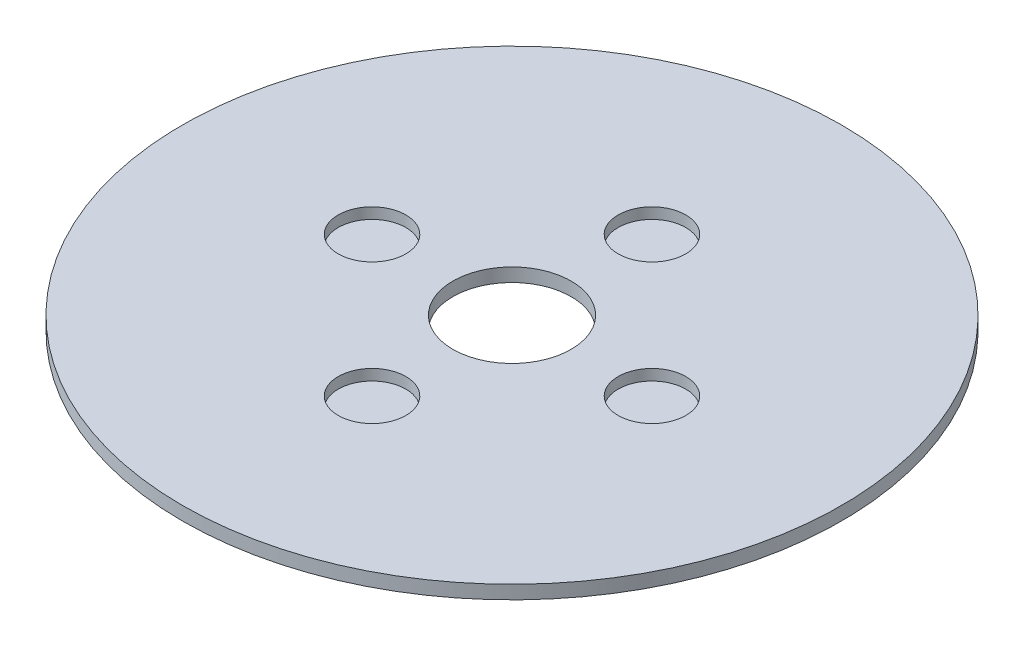
ISO-10303-21;
HEADER;
FILE_DESCRIPTION(('STEP AP214'),'2;1');
FILE_NAME('part.step','',(''),(''),'','','');
FILE_SCHEMA(('AUTOMOTIVE_DESIGN { 1 0 10303 214 1 1 1 1 }'));
ENDSEC;
DATA;
#1=APPLICATION_CONTEXT('core data for automotive mechanical design processes');
#2=APPLICATION_PROTOCOL_DEFINITION('international standard','automotive_design',2000,#1);
#3=PRODUCT_CONTEXT('',#1,'mechanical');
#4=PRODUCT('Part','Part','',(#3));
#5=PRODUCT_RELATED_PRODUCT_CATEGORY('part','',(#4));
#6=PRODUCT_DEFINITION_FORMATION('','',#4);
#7=PRODUCT_DEFINITION_CONTEXT('part definition',#1,'design');
#8=PRODUCT_DEFINITION('design','',#6,#7);
#9=PRODUCT_DEFINITION_SHAPE('','',#8);
#10=(LENGTH_UNIT() NAMED_UNIT(*) SI_UNIT(.MILLI.,.METRE.));
#11=(NAMED_UNIT(*) PLANE_ANGLE_UNIT() SI_UNIT($,.RADIAN.));
#12=(NAMED_UNIT(*) SI_UNIT($,.STERADIAN.) SOLID_ANGLE_UNIT());
#13=UNCERTAINTY_MEASURE_WITH_UNIT(LENGTH_MEASURE(1.E-05),#10,'distance_accuracy_value','');
#14=(GEOMETRIC_REPRESENTATION_CONTEXT(3) GLOBAL_UNCERTAINTY_ASSIGNED_CONTEXT((#13)) GLOBAL_UNIT_ASSIGNED_CONTEXT((#10,
#11,#12)) REPRESENTATION_CONTEXT('',''));
#15=CARTESIAN_POINT('',(0.,0.,0.));
#16=DIRECTION('',(0.,0.,1.));
#17=DIRECTION('',(1.,0.,0.));
#18=AXIS2_PLACEMENT_3D('',#15,#16,#17);
#19=CARTESIAN_POINT('',(0.,4.,0.));
#20=DIRECTION('',(0.,-1.,0.));
#21=DIRECTION('',(0.,0.,-1.));
#22=AXIS2_PLACEMENT_3D('',#19,#20,#21);
#23=CYLINDRICAL_SURFACE('',#22,97.5);
#24=CARTESIAN_POINT('',(0.,4.,0.));
#25=DIRECTION('',(0.,1.,0.));
#26=DIRECTION('',(0.,0.,1.));
#27=AXIS2_PLACEMENT_3D('',#24,#25,#26);
#28=CIRCLE('',#27,97.5);
#29=CARTESIAN_POINT('',(0.,4.,97.5));
#30=VERTEX_POINT('',#29);
#31=EDGE_CURVE('E10',#30,#30,#28,.T.);
#32=ORIENTED_EDGE('',*,*,#31,.F.);
#33=EDGE_LOOP('',(#32));
#34=FACE_BOUND('',#33,.T.);
#35=CARTESIAN_POINT('',(0.,0.,0.));
#36=DIRECTION('',(0.,1.,0.));
#37=DIRECTION('',(0.,0.,1.));
#38=AXIS2_PLACEMENT_3D('',#35,#36,#37);
#39=CIRCLE('',#38,97.5);
#40=CARTESIAN_POINT('',(0.,0.,97.5));
#41=VERTEX_POINT('',#40);
#42=EDGE_CURVE('E37',#41,#41,#39,.T.);
#43=ORIENTED_EDGE('',*,*,#42,.T.);
#44=EDGE_LOOP('',(#43));
#45=FACE_BOUND('',#44,.T.);
#46=ADVANCED_FACE('F40',(#34,#45),#23,.T.);
#47=CARTESIAN_POINT('',(0.,4.,0.));
#48=DIRECTION('',(0.,1.,0.));
#49=DIRECTION('',(0.,0.,1.));
#50=AXIS2_PLACEMENT_3D('',#47,#48,#49);
#51=PLANE('',#50);
#52=CARTESIAN_POINT('',(1.445771799954E-13,4.,41.4085501150937));
#53=DIRECTION('',(0.,1.,0.));
#54=DIRECTION('',(1.,0.,0.));
#55=AXIS2_PLACEMENT_3D('',#52,#53,#54);
#56=CIRCLE('',#55,10.);
#57=CARTESIAN_POINT('',(10.0000000000001,4.,41.4085501150937));
#58=VERTEX_POINT('',#57);
#59=EDGE_CURVE('E71',#58,#58,#56,.T.);
#60=ORIENTED_EDGE('',*,*,#59,.F.);
#61=EDGE_LOOP('',(#60));
#62=FACE_BOUND('',#61,.T.);
#63=CARTESIAN_POINT('',(41.4085501150937,4.,0.));
#64=DIRECTION('',(0.,1.,0.));
#65=DIRECTION('',(0.,0.,-1.));
#66=AXIS2_PLACEMENT_3D('',#63,#64,#65);
#67=CIRCLE('',#66,10.);
#68=CARTESIAN_POINT('',(41.4085501150937,4.,-10.));
#69=VERTEX_POINT('',#68);
#70=EDGE_CURVE('E70',#69,#69,#67,.T.);
#71=ORIENTED_EDGE('',*,*,#70,.F.);
#72=EDGE_LOOP('',(#71));
#73=FACE_BOUND('',#72,.T.);
#74=CARTESIAN_POINT('',(-4.33731539986201E-13,4.,-41.4085501150937));
#75=DIRECTION('',(0.,1.,0.));
#76=DIRECTION('',(-1.,0.,0.));
#77=AXIS2_PLACEMENT_3D('',#74,#75,#76);
#78=CIRCLE('',#77,10.);
#79=CARTESIAN_POINT('',(-10.0000000000004,4.,-41.4085501150936));
#80=VERTEX_POINT('',#79);
#81=EDGE_CURVE('E61',#80,#80,#78,.T.);
#82=ORIENTED_EDGE('',*,*,#81,.F.);
#83=EDGE_LOOP('',(#82));
#84=FACE_BOUND('',#83,.T.);
#85=CARTESIAN_POINT('',(-41.4085501150937,4.,0.));
#86=DIRECTION('',(0.,1.,0.));
#87=DIRECTION('',(0.,0.,1.));
#88=AXIS2_PLACEMENT_3D('',#85,#86,#87);
#89=CIRCLE('',#88,10.);
#90=CARTESIAN_POINT('',(-41.4085501150937,4.,10.));
#91=VERTEX_POINT('',#90);
#92=EDGE_CURVE('E54',#91,#91,#89,.T.);
#93=ORIENTED_EDGE('',*,*,#92,.F.);
#94=EDGE_LOOP('',(#93));
#95=FACE_BOUND('',#94,.T.);
#96=CARTESIAN_POINT('',(0.,4.,0.));
#97=DIRECTION('',(0.,1.,0.));
#98=DIRECTION('',(0.,0.,1.));
#99=AXIS2_PLACEMENT_3D('',#96,#97,#98);
#100=CIRCLE('',#99,17.5);
#101=CARTESIAN_POINT('',(0.,4.,17.5));
#102=VERTEX_POINT('',#101);
#103=EDGE_CURVE('E50',#102,#102,#100,.T.);
#104=ORIENTED_EDGE('',*,*,#103,.F.);
#105=EDGE_LOOP('',(#104));
#106=FACE_BOUND('',#105,.T.);
#107=ORIENTED_EDGE('',*,*,#31,.T.);
#108=EDGE_LOOP('',(#107));
#109=FACE_BOUND('',#108,.T.);
#110=ADVANCED_FACE('F86',(#62,#73,#84,#95,#106,#109),#51,.T.);
#111=CARTESIAN_POINT('',(0.,0.,0.));
#112=DIRECTION('',(0.,1.,0.));
#113=DIRECTION('',(0.,0.,1.));
#114=AXIS2_PLACEMENT_3D('',#111,#112,#113);
#115=PLANE('',#114);
#116=CARTESIAN_POINT('',(0.,0.,0.));
#117=DIRECTION('',(0.,1.,0.));
#118=DIRECTION('',(0.,0.,1.));
#119=AXIS2_PLACEMENT_3D('',#116,#117,#118);
#120=CIRCLE('',#119,17.5);
#121=CARTESIAN_POINT('',(0.,0.,17.5));
#122=VERTEX_POINT('',#121);
#123=EDGE_CURVE('E47',#122,#122,#120,.T.);
#124=ORIENTED_EDGE('',*,*,#123,.T.);
#125=EDGE_LOOP('',(#124));
#126=FACE_BOUND('',#125,.T.);
#127=ORIENTED_EDGE('',*,*,#42,.F.);
#128=EDGE_LOOP('',(#127));
#129=FACE_BOUND('',#128,.T.);
#130=ADVANCED_FACE('F93',(#126,#129),#115,.F.);
#131=CARTESIAN_POINT('',(0.,4.,0.));
#132=DIRECTION('',(0.,-1.,0.));
#133=DIRECTION('',(0.,0.,-1.));
#134=AXIS2_PLACEMENT_3D('',#131,#132,#133);
#135=CYLINDRICAL_SURFACE('',#134,17.5);
#136=ORIENTED_EDGE('',*,*,#103,.T.);
#137=EDGE_LOOP('',(#136));
#138=FACE_BOUND('',#137,.T.);
#139=ORIENTED_EDGE('',*,*,#123,.F.);
#140=EDGE_LOOP('',(#139));
#141=FACE_BOUND('',#140,.T.);
#142=ADVANCED_FACE('F101',(#138,#141),#135,.F.);
#143=CARTESIAN_POINT('',(-41.4085501150937,0.763273138565078,0.));
#144=DIRECTION('',(0.,1.,0.));
#145=DIRECTION('',(0.,0.,1.));
#146=AXIS2_PLACEMENT_3D('',#143,#144,#145);
#147=CYLINDRICAL_SURFACE('',#146,10.);
#148=CARTESIAN_POINT('',(-41.4085501150937,0.763273138565078,0.));
#149=DIRECTION('',(0.,1.,0.));
#150=DIRECTION('',(0.,0.,1.));
#151=AXIS2_PLACEMENT_3D('',#148,#149,#150);
#152=CIRCLE('',#151,10.);
#153=CARTESIAN_POINT('',(-41.4085501150937,0.763273138565078,10.));
#154=VERTEX_POINT('',#153);
#155=EDGE_CURVE('E55',#154,#154,#152,.T.);
#156=ORIENTED_EDGE('',*,*,#155,.F.);
#157=EDGE_LOOP('',(#156));
#158=FACE_BOUND('',#157,.T.);
#159=ORIENTED_EDGE('',*,*,#92,.T.);
#160=EDGE_LOOP('',(#159));
#161=FACE_BOUND('',#160,.T.);
#162=ADVANCED_FACE('F102',(#158,#161),#147,.F.);
#163=CARTESIAN_POINT('',(-41.4085501150937,0.763273138565078,0.));
#164=DIRECTION('',(0.,1.,0.));
#165=DIRECTION('',(0.,0.,1.));
#166=AXIS2_PLACEMENT_3D('',#163,#164,#165);
#167=PLANE('',#166);
#168=ORIENTED_EDGE('',*,*,#155,.T.);
#169=EDGE_LOOP('',(#168));
#170=FACE_BOUND('',#169,.T.);
#171=ADVANCED_FACE('F133',(#170),#167,.T.);
#172=CARTESIAN_POINT('',(-4.33731539986201E-13,0.763273138565078,-41.4085501150937));
#173=DIRECTION('',(0.,1.,0.));
#174=DIRECTION('',(0.,0.,1.));
#175=AXIS2_PLACEMENT_3D('',#172,#173,#174);
#176=CYLINDRICAL_SURFACE('',#175,10.);
#177=CARTESIAN_POINT('',(-4.33731539986201E-13,0.763273138565078,-41.4085501150937));
#178=DIRECTION('',(0.,1.,0.));
#179=DIRECTION('',(-1.,0.,0.));
#180=AXIS2_PLACEMENT_3D('',#177,#178,#179);
#181=CIRCLE('',#180,10.);
#182=CARTESIAN_POINT('',(-10.0000000000004,0.763273138565078,-41.4085501150936));
#183=VERTEX_POINT('',#182);
#184=EDGE_CURVE('E63',#183,#183,#181,.T.);
#185=ORIENTED_EDGE('',*,*,#184,.F.);
#186=EDGE_LOOP('',(#185));
#187=FACE_BOUND('',#186,.T.);
#188=ORIENTED_EDGE('',*,*,#81,.T.);
#189=EDGE_LOOP('',(#188));
#190=FACE_BOUND('',#189,.T.);
#191=ADVANCED_FACE('F142',(#187,#190),#176,.F.);
#192=CARTESIAN_POINT('',(-4.33731539986201E-13,0.763273138565078,-41.4085501150937));
#193=DIRECTION('',(0.,1.,0.));
#194=DIRECTION('',(-1.,0.,0.));
#195=AXIS2_PLACEMENT_3D('',#192,#193,#194);
#196=PLANE('',#195);
#197=ORIENTED_EDGE('',*,*,#184,.T.);
#198=EDGE_LOOP('',(#197));
#199=FACE_BOUND('',#198,.T.);
#200=ADVANCED_FACE('F156',(#199),#196,.T.);
#201=CARTESIAN_POINT('',(41.4085501150937,0.763273138565078,0.));
#202=DIRECTION('',(0.,1.,0.));
#203=DIRECTION('',(0.,0.,1.));
#204=AXIS2_PLACEMENT_3D('',#201,#202,#203);
#205=CYLINDRICAL_SURFACE('',#204,10.);
#206=CARTESIAN_POINT('',(41.4085501150937,0.763273138565078,0.));
#207=DIRECTION('',(0.,1.,0.));
#208=DIRECTION('',(0.,0.,-1.));
#209=AXIS2_PLACEMENT_3D('',#206,#207,#208);
#210=CIRCLE('',#209,10.);
#211=CARTESIAN_POINT('',(41.4085501150937,0.763273138565078,-10.));
#212=VERTEX_POINT('',#211);
#213=EDGE_CURVE('E69',#212,#212,#210,.T.);
#214=ORIENTED_EDGE('',*,*,#213,.F.);
#215=EDGE_LOOP('',(#214));
#216=FACE_BOUND('',#215,.T.);
#217=ORIENTED_EDGE('',*,*,#70,.T.);
#218=EDGE_LOOP('',(#217));
#219=FACE_BOUND('',#218,.T.);
#220=ADVANCED_FACE('F164',(#216,#219),#205,.F.);
#221=CARTESIAN_POINT('',(41.4085501150937,0.763273138565078,0.));
#222=DIRECTION('',(0.,1.,0.));
#223=DIRECTION('',(0.,0.,-1.));
#224=AXIS2_PLACEMENT_3D('',#221,#222,#223);
#225=PLANE('',#224);
#226=ORIENTED_EDGE('',*,*,#213,.T.);
#227=EDGE_LOOP('',(#226));
#228=FACE_BOUND('',#227,.T.);
#229=ADVANCED_FACE('F83',(#228),#225,.T.);
#230=CARTESIAN_POINT('',(1.445771799954E-13,0.763273138565078,41.4085501150937));
#231=DIRECTION('',(0.,1.,0.));
#232=DIRECTION('',(0.,0.,1.));
#233=AXIS2_PLACEMENT_3D('',#230,#231,#232);
#234=CYLINDRICAL_SURFACE('',#233,10.);
#235=CARTESIAN_POINT('',(1.445771799954E-13,0.763273138565078,41.4085501150937));
#236=DIRECTION('',(0.,1.,0.));
#237=DIRECTION('',(1.,0.,0.));
#238=AXIS2_PLACEMENT_3D('',#235,#236,#237);
#239=CIRCLE('',#238,10.);
#240=CARTESIAN_POINT('',(10.0000000000001,0.763273138565078,41.4085501150937));
#241=VERTEX_POINT('',#240);
#242=EDGE_CURVE('E59',#241,#241,#239,.T.);
#243=ORIENTED_EDGE('',*,*,#242,.F.);
#244=EDGE_LOOP('',(#243));
#245=FACE_BOUND('',#244,.T.);
#246=ORIENTED_EDGE('',*,*,#59,.T.);
#247=EDGE_LOOP('',(#246));
#248=FACE_BOUND('',#247,.T.);
#249=ADVANCED_FACE('F81',(#245,#248),#234,.F.);
#250=CARTESIAN_POINT('',(1.445771799954E-13,0.763273138565078,41.4085501150937));
#251=DIRECTION('',(0.,1.,0.));
#252=DIRECTION('',(1.,0.,0.));
#253=AXIS2_PLACEMENT_3D('',#250,#251,#252);
#254=PLANE('',#253);
#255=ORIENTED_EDGE('',*,*,#242,.T.);
#256=EDGE_LOOP('',(#255));
#257=FACE_BOUND('',#256,.T.);
#258=ADVANCED_FACE('F78',(#257),#254,.T.);
#259=CLOSED_SHELL('',(#46,#110,#130,#142,#162,#171,#191,#200,#220,#229,#249,#258));
#260=MANIFOLD_SOLID_BREP('B2',#259);
#261=ADVANCED_BREP_SHAPE_REPRESENTATION('',(#18,#260),#14);
#262=SHAPE_DEFINITION_REPRESENTATION(#9,#261);
ENDSEC;
END-ISO-10303-21;
